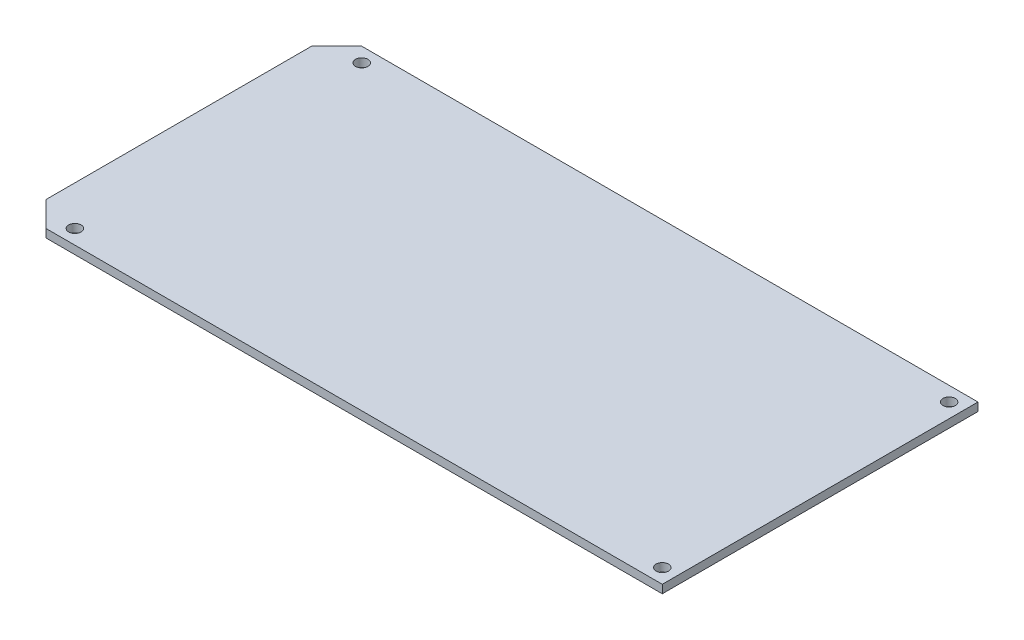
ISO-10303-21;
HEADER;
FILE_DESCRIPTION(('STEP AP214'),'2;1');
FILE_NAME('part.step','',(''),(''),'','','');
FILE_SCHEMA(('AUTOMOTIVE_DESIGN { 1 0 10303 214 1 1 1 1 }'));
ENDSEC;
DATA;
#1=APPLICATION_CONTEXT('core data for automotive mechanical design processes');
#2=APPLICATION_PROTOCOL_DEFINITION('international standard','automotive_design',2000,#1);
#3=PRODUCT_CONTEXT('',#1,'mechanical');
#4=PRODUCT('Part','Part','',(#3));
#5=PRODUCT_RELATED_PRODUCT_CATEGORY('part','',(#4));
#6=PRODUCT_DEFINITION_FORMATION('','',#4);
#7=PRODUCT_DEFINITION_CONTEXT('part definition',#1,'design');
#8=PRODUCT_DEFINITION('design','',#6,#7);
#9=PRODUCT_DEFINITION_SHAPE('','',#8);
#10=(LENGTH_UNIT() NAMED_UNIT(*) SI_UNIT(.MILLI.,.METRE.));
#11=(NAMED_UNIT(*) PLANE_ANGLE_UNIT() SI_UNIT($,.RADIAN.));
#12=(NAMED_UNIT(*) SI_UNIT($,.STERADIAN.) SOLID_ANGLE_UNIT());
#13=UNCERTAINTY_MEASURE_WITH_UNIT(LENGTH_MEASURE(1.E-05),#10,'distance_accuracy_value','');
#14=(GEOMETRIC_REPRESENTATION_CONTEXT(3) GLOBAL_UNCERTAINTY_ASSIGNED_CONTEXT((#13)) GLOBAL_UNIT_ASSIGNED_CONTEXT((#10,
#11,#12)) REPRESENTATION_CONTEXT('',''));
#15=CARTESIAN_POINT('',(0.,0.,0.));
#16=DIRECTION('',(0.,0.,1.));
#17=DIRECTION('',(1.,0.,0.));
#18=AXIS2_PLACEMENT_3D('',#15,#16,#17);
#19=CARTESIAN_POINT('',(0.,2.,0.));
#20=DIRECTION('',(0.,1.,0.));
#21=DIRECTION('',(0.,0.,1.));
#22=AXIS2_PLACEMENT_3D('',#19,#20,#21);
#23=PLANE('',#22);
#24=CARTESIAN_POINT('',(-145.77,2.,-72.97));
#25=DIRECTION('',(0.,1.,0.));
#26=DIRECTION('',(0.,0.,1.));
#27=AXIS2_PLACEMENT_3D('',#24,#25,#26);
#28=CIRCLE('',#27,1.5);
#29=CARTESIAN_POINT('',(-145.77,2.,-71.47));
#30=VERTEX_POINT('',#29);
#31=EDGE_CURVE('E212',#30,#30,#28,.T.);
#32=ORIENTED_EDGE('',*,*,#31,.F.);
#33=EDGE_LOOP('',(#32));
#34=FACE_BOUND('',#33,.T.);
#35=CARTESIAN_POINT('',(-3.5,2.,-72.97));
#36=DIRECTION('',(0.,1.,0.));
#37=DIRECTION('',(0.,0.,1.));
#38=AXIS2_PLACEMENT_3D('',#35,#36,#37);
#39=CIRCLE('',#38,1.50000000000001);
#40=CARTESIAN_POINT('',(-3.5,2.,-71.47));
#41=VERTEX_POINT('',#40);
#42=EDGE_CURVE('E134',#41,#41,#39,.T.);
#43=ORIENTED_EDGE('',*,*,#42,.F.);
#44=EDGE_LOOP('',(#43));
#45=FACE_BOUND('',#44,.T.);
#46=DIRECTION('',(0.,0.,-1.));
#47=VECTOR('',#46,1.);
#48=CARTESIAN_POINT('',(0.,2.,-76.47));
#49=LINE('',#48,#47);
#50=CARTESIAN_POINT('',(0.,2.,0.));
#51=VERTEX_POINT('',#50);
#52=CARTESIAN_POINT('',(0.,2.,-76.47));
#53=VERTEX_POINT('',#52);
#54=EDGE_CURVE('E146',#51,#53,#49,.T.);
#55=ORIENTED_EDGE('',*,*,#54,.T.);
#56=DIRECTION('',(-1.,0.,0.));
#57=VECTOR('',#56,1.);
#58=CARTESIAN_POINT('',(-149.27,2.,-76.47));
#59=LINE('',#58,#57);
#60=CARTESIAN_POINT('',(-149.27,2.,-76.47));
#61=VERTEX_POINT('',#60);
#62=EDGE_CURVE('E94',#53,#61,#59,.T.);
#63=ORIENTED_EDGE('',*,*,#62,.T.);
#64=DIRECTION('',(-0.707106781186553,0.,0.707106781186542));
#65=VECTOR('',#64,1.);
#66=CARTESIAN_POINT('',(-149.27,2.,-76.47));
#67=LINE('',#66,#65);
#68=CARTESIAN_POINT('',(-155.344047250392,2.,-70.3959527496076));
#69=VERTEX_POINT('',#68);
#70=EDGE_CURVE('E107',#61,#69,#67,.T.);
#71=ORIENTED_EDGE('',*,*,#70,.T.);
#72=DIRECTION('',(0.,0.,1.));
#73=VECTOR('',#72,1.);
#74=CARTESIAN_POINT('',(-155.344047250392,2.,-70.3959527496076));
#75=LINE('',#74,#73);
#76=CARTESIAN_POINT('',(-155.344047250392,2.,-6.07404725039243));
#77=VERTEX_POINT('',#76);
#78=EDGE_CURVE('E101',#69,#77,#75,.T.);
#79=ORIENTED_EDGE('',*,*,#78,.T.);
#80=DIRECTION('',(0.707106781186547,0.,0.707106781186548));
#81=VECTOR('',#80,1.);
#82=CARTESIAN_POINT('',(-155.344047250392,2.,-6.07404725039243));
#83=LINE('',#82,#81);
#84=CARTESIAN_POINT('',(-149.27,2.,0.));
#85=VERTEX_POINT('',#84);
#86=EDGE_CURVE('E105',#77,#85,#83,.T.);
#87=ORIENTED_EDGE('',*,*,#86,.T.);
#88=DIRECTION('',(1.,0.,0.));
#89=VECTOR('',#88,1.);
#90=CARTESIAN_POINT('',(-149.27,2.,0.));
#91=LINE('',#90,#89);
#92=EDGE_CURVE('E57',#85,#51,#91,.T.);
#93=ORIENTED_EDGE('',*,*,#92,.T.);
#94=EDGE_LOOP('',(#55,#63,#71,#79,#87,#93));
#95=FACE_BOUND('',#94,.T.);
#96=CARTESIAN_POINT('',(-3.49999999999999,2.,-3.5));
#97=DIRECTION('',(0.,1.,0.));
#98=DIRECTION('',(0.,0.,1.));
#99=AXIS2_PLACEMENT_3D('',#96,#97,#98);
#100=CIRCLE('',#99,1.5);
#101=CARTESIAN_POINT('',(-3.49999999999999,2.,-2.));
#102=VERTEX_POINT('',#101);
#103=EDGE_CURVE('E220',#102,#102,#100,.T.);
#104=ORIENTED_EDGE('',*,*,#103,.F.);
#105=EDGE_LOOP('',(#104));
#106=FACE_BOUND('',#105,.T.);
#107=CARTESIAN_POINT('',(-145.77,2.,-3.5));
#108=DIRECTION('',(0.,1.,0.));
#109=DIRECTION('',(0.,0.,1.));
#110=AXIS2_PLACEMENT_3D('',#107,#108,#109);
#111=CIRCLE('',#110,1.5);
#112=CARTESIAN_POINT('',(-145.77,2.,-2.));
#113=VERTEX_POINT('',#112);
#114=EDGE_CURVE('E201',#113,#113,#111,.T.);
#115=ORIENTED_EDGE('',*,*,#114,.F.);
#116=EDGE_LOOP('',(#115));
#117=FACE_BOUND('',#116,.T.);
#118=ADVANCED_FACE('F39',(#34,#45,#95,#106,#117),#23,.T.);
#119=CARTESIAN_POINT('',(0.,0.,0.));
#120=DIRECTION('',(0.,1.,0.));
#121=DIRECTION('',(0.,0.,1.));
#122=AXIS2_PLACEMENT_3D('',#119,#120,#121);
#123=PLANE('',#122);
#124=DIRECTION('',(0.,0.,-1.));
#125=VECTOR('',#124,1.);
#126=CARTESIAN_POINT('',(0.,0.,-76.47));
#127=LINE('',#126,#125);
#128=CARTESIAN_POINT('',(0.,0.,0.));
#129=VERTEX_POINT('',#128);
#130=CARTESIAN_POINT('',(0.,0.,-76.47));
#131=VERTEX_POINT('',#130);
#132=EDGE_CURVE('E129',#129,#131,#127,.T.);
#133=ORIENTED_EDGE('',*,*,#132,.F.);
#134=DIRECTION('',(1.,0.,0.));
#135=VECTOR('',#134,1.);
#136=CARTESIAN_POINT('',(-149.27,0.,0.));
#137=LINE('',#136,#135);
#138=CARTESIAN_POINT('',(-149.27,0.,0.));
#139=VERTEX_POINT('',#138);
#140=EDGE_CURVE('E86',#139,#129,#137,.T.);
#141=ORIENTED_EDGE('',*,*,#140,.F.);
#142=DIRECTION('',(0.707106781186547,0.,0.707106781186548));
#143=VECTOR('',#142,1.);
#144=CARTESIAN_POINT('',(-155.344047250392,0.,-6.07404725039243));
#145=LINE('',#144,#143);
#146=CARTESIAN_POINT('',(-155.344047250392,0.,-6.07404725039243));
#147=VERTEX_POINT('',#146);
#148=EDGE_CURVE('E80',#147,#139,#145,.T.);
#149=ORIENTED_EDGE('',*,*,#148,.F.);
#150=DIRECTION('',(0.,0.,1.));
#151=VECTOR('',#150,1.);
#152=CARTESIAN_POINT('',(-155.344047250392,0.,-70.3959527496076));
#153=LINE('',#152,#151);
#154=CARTESIAN_POINT('',(-155.344047250392,0.,-70.3959527496076));
#155=VERTEX_POINT('',#154);
#156=EDGE_CURVE('E116',#155,#147,#153,.T.);
#157=ORIENTED_EDGE('',*,*,#156,.F.);
#158=DIRECTION('',(-0.707106781186553,0.,0.707106781186542));
#159=VECTOR('',#158,1.);
#160=CARTESIAN_POINT('',(-149.27,0.,-76.47));
#161=LINE('',#160,#159);
#162=CARTESIAN_POINT('',(-149.27,0.,-76.47));
#163=VERTEX_POINT('',#162);
#164=EDGE_CURVE('E137',#163,#155,#161,.T.);
#165=ORIENTED_EDGE('',*,*,#164,.F.);
#166=DIRECTION('',(-1.,0.,0.));
#167=VECTOR('',#166,1.);
#168=CARTESIAN_POINT('',(-149.27,0.,-76.47));
#169=LINE('',#168,#167);
#170=EDGE_CURVE('E133',#131,#163,#169,.T.);
#171=ORIENTED_EDGE('',*,*,#170,.F.);
#172=EDGE_LOOP('',(#133,#141,#149,#157,#165,#171));
#173=FACE_BOUND('',#172,.T.);
#174=CARTESIAN_POINT('',(-3.5,0.,-72.97));
#175=DIRECTION('',(0.,1.,0.));
#176=DIRECTION('',(0.,0.,1.));
#177=AXIS2_PLACEMENT_3D('',#174,#175,#176);
#178=CIRCLE('',#177,1.50000000000001);
#179=CARTESIAN_POINT('',(-3.5,0.,-71.47));
#180=VERTEX_POINT('',#179);
#181=EDGE_CURVE('E224',#180,#180,#178,.T.);
#182=ORIENTED_EDGE('',*,*,#181,.T.);
#183=EDGE_LOOP('',(#182));
#184=FACE_BOUND('',#183,.T.);
#185=CARTESIAN_POINT('',(-3.49999999999999,0.,-3.5));
#186=DIRECTION('',(0.,1.,0.));
#187=DIRECTION('',(0.,0.,1.));
#188=AXIS2_PLACEMENT_3D('',#185,#186,#187);
#189=CIRCLE('',#188,1.5);
#190=CARTESIAN_POINT('',(-3.49999999999999,0.,-2.));
#191=VERTEX_POINT('',#190);
#192=EDGE_CURVE('E216',#191,#191,#189,.T.);
#193=ORIENTED_EDGE('',*,*,#192,.T.);
#194=EDGE_LOOP('',(#193));
#195=FACE_BOUND('',#194,.T.);
#196=CARTESIAN_POINT('',(-145.77,0.,-72.97));
#197=DIRECTION('',(0.,1.,0.));
#198=DIRECTION('',(0.,0.,1.));
#199=AXIS2_PLACEMENT_3D('',#196,#197,#198);
#200=CIRCLE('',#199,1.5);
#201=CARTESIAN_POINT('',(-145.77,0.,-71.47));
#202=VERTEX_POINT('',#201);
#203=EDGE_CURVE('E209',#202,#202,#200,.T.);
#204=ORIENTED_EDGE('',*,*,#203,.T.);
#205=EDGE_LOOP('',(#204));
#206=FACE_BOUND('',#205,.T.);
#207=CARTESIAN_POINT('',(-145.77,0.,-3.5));
#208=DIRECTION('',(0.,1.,0.));
#209=DIRECTION('',(0.,0.,1.));
#210=AXIS2_PLACEMENT_3D('',#207,#208,#209);
#211=CIRCLE('',#210,1.5);
#212=CARTESIAN_POINT('',(-145.77,0.,-2.));
#213=VERTEX_POINT('',#212);
#214=EDGE_CURVE('E204',#213,#213,#211,.T.);
#215=ORIENTED_EDGE('',*,*,#214,.T.);
#216=EDGE_LOOP('',(#215));
#217=FACE_BOUND('',#216,.T.);
#218=ADVANCED_FACE('F159',(#173,#184,#195,#206,#217),#123,.F.);
#219=CARTESIAN_POINT('',(0.,2.,-76.47));
#220=DIRECTION('',(-1.,0.,0.));
#221=DIRECTION('',(0.,0.,1.));
#222=AXIS2_PLACEMENT_3D('',#219,#220,#221);
#223=PLANE('',#222);
#224=ORIENTED_EDGE('',*,*,#132,.T.);
#225=DIRECTION('',(0.,-1.,0.));
#226=VECTOR('',#225,1.);
#227=CARTESIAN_POINT('',(0.,2.,-76.47));
#228=LINE('',#227,#226);
#229=EDGE_CURVE('E11',#53,#131,#228,.T.);
#230=ORIENTED_EDGE('',*,*,#229,.F.);
#231=ORIENTED_EDGE('',*,*,#54,.F.);
#232=DIRECTION('',(0.,-1.,0.));
#233=VECTOR('',#232,1.);
#234=CARTESIAN_POINT('',(0.,2.,0.));
#235=LINE('',#234,#233);
#236=EDGE_CURVE('E125',#51,#129,#235,.T.);
#237=ORIENTED_EDGE('',*,*,#236,.T.);
#238=EDGE_LOOP('',(#224,#230,#231,#237));
#239=FACE_BOUND('',#238,.T.);
#240=ADVANCED_FACE('F41',(#239),#223,.F.);
#241=CARTESIAN_POINT('',(-149.27,2.,-76.47));
#242=DIRECTION('',(0.,0.,1.));
#243=DIRECTION('',(1.,0.,0.));
#244=AXIS2_PLACEMENT_3D('',#241,#242,#243);
#245=PLANE('',#244);
#246=ORIENTED_EDGE('',*,*,#170,.T.);
#247=DIRECTION('',(0.,-1.,0.));
#248=VECTOR('',#247,1.);
#249=CARTESIAN_POINT('',(-149.27,2.,-76.47));
#250=LINE('',#249,#248);
#251=EDGE_CURVE('E49',#61,#163,#250,.T.);
#252=ORIENTED_EDGE('',*,*,#251,.F.);
#253=ORIENTED_EDGE('',*,*,#62,.F.);
#254=ORIENTED_EDGE('',*,*,#229,.T.);
#255=EDGE_LOOP('',(#246,#252,#253,#254));
#256=FACE_BOUND('',#255,.T.);
#257=ADVANCED_FACE('F288',(#256),#245,.F.);
#258=CARTESIAN_POINT('',(-149.27,2.,-76.47));
#259=DIRECTION('',(0.707106781186542,0.,0.707106781186553));
#260=DIRECTION('',(0.707106781186553,0.,-0.707106781186542));
#261=AXIS2_PLACEMENT_3D('',#258,#259,#260);
#262=PLANE('',#261);
#263=ORIENTED_EDGE('',*,*,#164,.T.);
#264=DIRECTION('',(0.,-1.,0.));
#265=VECTOR('',#264,1.);
#266=CARTESIAN_POINT('',(-155.344047250392,2.,-70.3959527496076));
#267=LINE('',#266,#265);
#268=EDGE_CURVE('E118',#69,#155,#267,.T.);
#269=ORIENTED_EDGE('',*,*,#268,.F.);
#270=ORIENTED_EDGE('',*,*,#70,.F.);
#271=ORIENTED_EDGE('',*,*,#251,.T.);
#272=EDGE_LOOP('',(#263,#269,#270,#271));
#273=FACE_BOUND('',#272,.T.);
#274=ADVANCED_FACE('F156',(#273),#262,.F.);
#275=CARTESIAN_POINT('',(-155.344047250392,2.,-70.3959527496076));
#276=DIRECTION('',(1.,0.,0.));
#277=DIRECTION('',(0.,0.,-1.));
#278=AXIS2_PLACEMENT_3D('',#275,#276,#277);
#279=PLANE('',#278);
#280=ORIENTED_EDGE('',*,*,#156,.T.);
#281=DIRECTION('',(0.,-1.,0.));
#282=VECTOR('',#281,1.);
#283=CARTESIAN_POINT('',(-155.344047250392,2.,-6.07404725039243));
#284=LINE('',#283,#282);
#285=EDGE_CURVE('E113',#77,#147,#284,.T.);
#286=ORIENTED_EDGE('',*,*,#285,.F.);
#287=ORIENTED_EDGE('',*,*,#78,.F.);
#288=ORIENTED_EDGE('',*,*,#268,.T.);
#289=EDGE_LOOP('',(#280,#286,#287,#288));
#290=FACE_BOUND('',#289,.T.);
#291=ADVANCED_FACE('F114',(#290),#279,.F.);
#292=CARTESIAN_POINT('',(-155.344047250392,2.,-6.07404725039243));
#293=DIRECTION('',(0.707106781186548,0.,-0.707106781186547));
#294=DIRECTION('',(-0.707106781186547,0.,-0.707106781186548));
#295=AXIS2_PLACEMENT_3D('',#292,#293,#294);
#296=PLANE('',#295);
#297=ORIENTED_EDGE('',*,*,#148,.T.);
#298=DIRECTION('',(0.,-1.,0.));
#299=VECTOR('',#298,1.);
#300=CARTESIAN_POINT('',(-149.27,2.,0.));
#301=LINE('',#300,#299);
#302=EDGE_CURVE('E119',#85,#139,#301,.T.);
#303=ORIENTED_EDGE('',*,*,#302,.F.);
#304=ORIENTED_EDGE('',*,*,#86,.F.);
#305=ORIENTED_EDGE('',*,*,#285,.T.);
#306=EDGE_LOOP('',(#297,#303,#304,#305));
#307=FACE_BOUND('',#306,.T.);
#308=ADVANCED_FACE('F121',(#307),#296,.F.);
#309=CARTESIAN_POINT('',(-149.27,2.,0.));
#310=DIRECTION('',(0.,0.,-1.));
#311=DIRECTION('',(-1.,0.,0.));
#312=AXIS2_PLACEMENT_3D('',#309,#310,#311);
#313=PLANE('',#312);
#314=ORIENTED_EDGE('',*,*,#140,.T.);
#315=ORIENTED_EDGE('',*,*,#236,.F.);
#316=ORIENTED_EDGE('',*,*,#92,.F.);
#317=ORIENTED_EDGE('',*,*,#302,.T.);
#318=EDGE_LOOP('',(#314,#315,#316,#317));
#319=FACE_BOUND('',#318,.T.);
#320=ADVANCED_FACE('F164',(#319),#313,.F.);
#321=CARTESIAN_POINT('',(-3.5,2.,-72.97));
#322=DIRECTION('',(0.,-1.,0.));
#323=DIRECTION('',(0.,0.,-1.));
#324=AXIS2_PLACEMENT_3D('',#321,#322,#323);
#325=CYLINDRICAL_SURFACE('',#324,1.50000000000001);
#326=ORIENTED_EDGE('',*,*,#42,.T.);
#327=EDGE_LOOP('',(#326));
#328=FACE_BOUND('',#327,.T.);
#329=ORIENTED_EDGE('',*,*,#181,.F.);
#330=EDGE_LOOP('',(#329));
#331=FACE_BOUND('',#330,.T.);
#332=ADVANCED_FACE('F166',(#328,#331),#325,.F.);
#333=CARTESIAN_POINT('',(-3.49999999999999,2.,-3.5));
#334=DIRECTION('',(0.,-1.,0.));
#335=DIRECTION('',(0.,0.,-1.));
#336=AXIS2_PLACEMENT_3D('',#333,#334,#335);
#337=CYLINDRICAL_SURFACE('',#336,1.5);
#338=ORIENTED_EDGE('',*,*,#103,.T.);
#339=EDGE_LOOP('',(#338));
#340=FACE_BOUND('',#339,.T.);
#341=ORIENTED_EDGE('',*,*,#192,.F.);
#342=EDGE_LOOP('',(#341));
#343=FACE_BOUND('',#342,.T.);
#344=ADVANCED_FACE('F172',(#340,#343),#337,.F.);
#345=CARTESIAN_POINT('',(-145.77,2.,-72.97));
#346=DIRECTION('',(0.,-1.,0.));
#347=DIRECTION('',(0.,0.,-1.));
#348=AXIS2_PLACEMENT_3D('',#345,#346,#347);
#349=CYLINDRICAL_SURFACE('',#348,1.5);
#350=ORIENTED_EDGE('',*,*,#31,.T.);
#351=EDGE_LOOP('',(#350));
#352=FACE_BOUND('',#351,.T.);
#353=ORIENTED_EDGE('',*,*,#203,.F.);
#354=EDGE_LOOP('',(#353));
#355=FACE_BOUND('',#354,.T.);
#356=ADVANCED_FACE('F188',(#352,#355),#349,.F.);
#357=CARTESIAN_POINT('',(-145.77,2.,-3.5));
#358=DIRECTION('',(0.,-1.,0.));
#359=DIRECTION('',(0.,0.,-1.));
#360=AXIS2_PLACEMENT_3D('',#357,#358,#359);
#361=CYLINDRICAL_SURFACE('',#360,1.5);
#362=ORIENTED_EDGE('',*,*,#114,.T.);
#363=EDGE_LOOP('',(#362));
#364=FACE_BOUND('',#363,.T.);
#365=ORIENTED_EDGE('',*,*,#214,.F.);
#366=EDGE_LOOP('',(#365));
#367=FACE_BOUND('',#366,.T.);
#368=ADVANCED_FACE('F192',(#364,#367),#361,.F.);
#369=CLOSED_SHELL('',(#118,#218,#240,#257,#274,#291,#308,#320,#332,#344,#356,#368));
#370=MANIFOLD_SOLID_BREP('B2',#369);
#371=ADVANCED_BREP_SHAPE_REPRESENTATION('',(#18,#370),#14);
#372=SHAPE_DEFINITION_REPRESENTATION(#9,#371);
ENDSEC;
END-ISO-10303-21;
